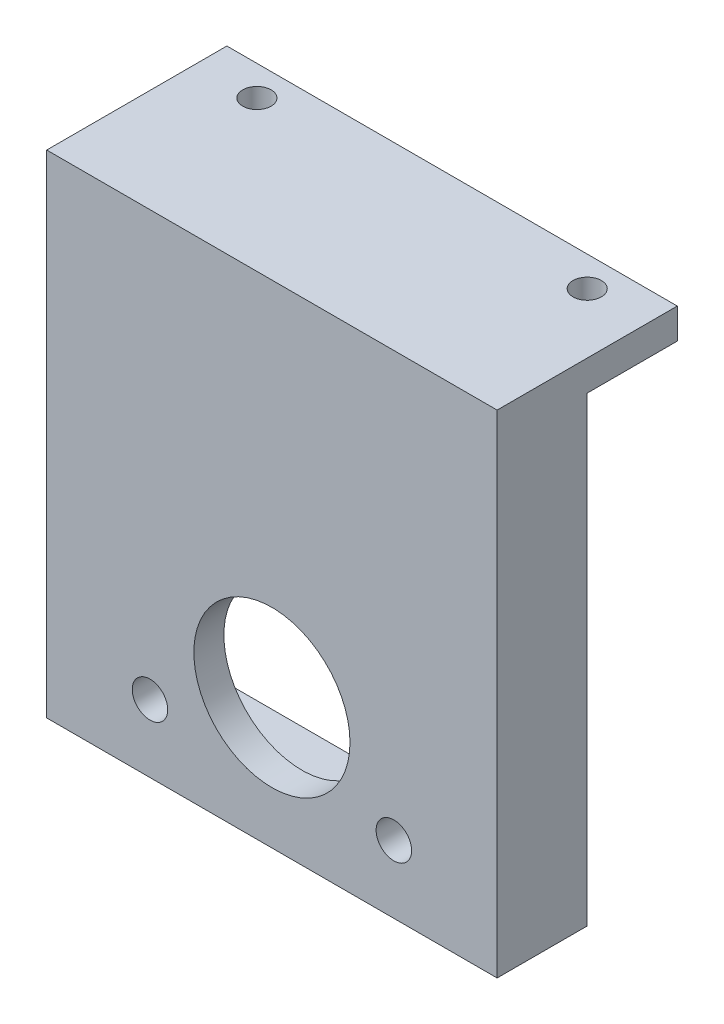
ISO-10303-21;
HEADER;
FILE_DESCRIPTION(('STEP AP214'),'2;1');
FILE_NAME('part.step','',(''),(''),'','','');
FILE_SCHEMA(('AUTOMOTIVE_DESIGN { 1 0 10303 214 1 1 1 1 }'));
ENDSEC;
DATA;
#1=APPLICATION_CONTEXT('core data for automotive mechanical design processes');
#2=APPLICATION_PROTOCOL_DEFINITION('international standard','automotive_design',2000,#1);
#3=PRODUCT_CONTEXT('',#1,'mechanical');
#4=PRODUCT('Part','Part','',(#3));
#5=PRODUCT_RELATED_PRODUCT_CATEGORY('part','',(#4));
#6=PRODUCT_DEFINITION_FORMATION('','',#4);
#7=PRODUCT_DEFINITION_CONTEXT('part definition',#1,'design');
#8=PRODUCT_DEFINITION('design','',#6,#7);
#9=PRODUCT_DEFINITION_SHAPE('','',#8);
#10=(LENGTH_UNIT() NAMED_UNIT(*) SI_UNIT(.MILLI.,.METRE.));
#11=(NAMED_UNIT(*) PLANE_ANGLE_UNIT() SI_UNIT($,.RADIAN.));
#12=(NAMED_UNIT(*) SI_UNIT($,.STERADIAN.) SOLID_ANGLE_UNIT());
#13=UNCERTAINTY_MEASURE_WITH_UNIT(LENGTH_MEASURE(1.E-05),#10,'distance_accuracy_value','');
#14=(GEOMETRIC_REPRESENTATION_CONTEXT(3) GLOBAL_UNCERTAINTY_ASSIGNED_CONTEXT((#13)) GLOBAL_UNIT_ASSIGNED_CONTEXT((#10,
#11,#12)) REPRESENTATION_CONTEXT('',''));
#15=CARTESIAN_POINT('',(0.,0.,0.));
#16=DIRECTION('',(0.,0.,1.));
#17=DIRECTION('',(1.,0.,0.));
#18=AXIS2_PLACEMENT_3D('',#15,#16,#17);
#19=CARTESIAN_POINT('',(0.,0.,0.));
#20=DIRECTION('',(0.,0.,-1.));
#21=DIRECTION('',(-1.,0.,0.));
#22=AXIS2_PLACEMENT_3D('',#19,#20,#21);
#23=PLANE('',#22);
#24=DIRECTION('',(-0.999999710307042,0.000761173982153334,0.));
#25=VECTOR('',#24,1.);
#26=CARTESIAN_POINT('',(19.05,39.0361992628786,0.));
#27=LINE('',#26,#25);
#28=CARTESIAN_POINT('',(19.05,39.0361992628786,0.));
#29=VERTEX_POINT('',#28);
#30=CARTESIAN_POINT('',(-19.05,39.0652,0.));
#31=VERTEX_POINT('',#30);
#32=EDGE_CURVE('E57',#29,#31,#27,.T.);
#33=ORIENTED_EDGE('',*,*,#32,.F.);
#34=DIRECTION('',(0.,1.,0.));
#35=VECTOR('',#34,1.);
#36=CARTESIAN_POINT('',(19.05,41.6052,0.));
#37=LINE('',#36,#35);
#38=CARTESIAN_POINT('',(19.05,0.,0.));
#39=VERTEX_POINT('',#38);
#40=EDGE_CURVE('E239',#39,#29,#37,.T.);
#41=ORIENTED_EDGE('',*,*,#40,.F.);
#42=DIRECTION('',(1.,0.,0.));
#43=VECTOR('',#42,1.);
#44=CARTESIAN_POINT('',(-19.05,0.,0.));
#45=LINE('',#44,#43);
#46=CARTESIAN_POINT('',(-19.05,0.,0.));
#47=VERTEX_POINT('',#46);
#48=EDGE_CURVE('E236',#47,#39,#45,.T.);
#49=ORIENTED_EDGE('',*,*,#48,.F.);
#50=DIRECTION('',(0.,-1.,0.));
#51=VECTOR('',#50,1.);
#52=CARTESIAN_POINT('',(-19.05,41.6052,0.));
#53=LINE('',#52,#51);
#54=EDGE_CURVE('E127',#31,#47,#53,.T.);
#55=ORIENTED_EDGE('',*,*,#54,.F.);
#56=EDGE_LOOP('',(#33,#41,#49,#55));
#57=FACE_BOUND('',#56,.T.);
#58=DIRECTION('',(0.,1.,0.));
#59=VECTOR('',#58,1.);
#60=CARTESIAN_POINT('',(16.51,2.54,0.));
#61=LINE('',#60,#59);
#62=CARTESIAN_POINT('',(16.51,2.54,0.));
#63=VERTEX_POINT('',#62);
#64=CARTESIAN_POINT('',(16.51,36.5252,0.));
#65=VERTEX_POINT('',#64);
#66=EDGE_CURVE('E199',#63,#65,#61,.T.);
#67=ORIENTED_EDGE('',*,*,#66,.T.);
#68=DIRECTION('',(-1.,0.,0.));
#69=VECTOR('',#68,1.);
#70=CARTESIAN_POINT('',(-16.51,36.5252,0.));
#71=LINE('',#70,#69);
#72=CARTESIAN_POINT('',(-16.51,36.5252,0.));
#73=VERTEX_POINT('',#72);
#74=EDGE_CURVE('E65',#65,#73,#71,.T.);
#75=ORIENTED_EDGE('',*,*,#74,.T.);
#76=DIRECTION('',(0.,-1.,0.));
#77=VECTOR('',#76,1.);
#78=CARTESIAN_POINT('',(-16.51,36.5252,0.));
#79=LINE('',#78,#77);
#80=CARTESIAN_POINT('',(-16.51,2.54,0.));
#81=VERTEX_POINT('',#80);
#82=EDGE_CURVE('E214',#73,#81,#79,.T.);
#83=ORIENTED_EDGE('',*,*,#82,.T.);
#84=DIRECTION('',(1.,0.,0.));
#85=VECTOR('',#84,1.);
#86=CARTESIAN_POINT('',(-16.51,2.54,0.));
#87=LINE('',#86,#85);
#88=EDGE_CURVE('E218',#81,#63,#87,.T.);
#89=ORIENTED_EDGE('',*,*,#88,.T.);
#90=EDGE_LOOP('',(#67,#75,#83,#89));
#91=FACE_BOUND('',#90,.T.);
#92=ADVANCED_FACE('F39',(#57,#91),#23,.T.);
#93=CARTESIAN_POINT('',(-19.05,0.,5.08));
#94=DIRECTION('',(0.,1.,0.));
#95=DIRECTION('',(0.,0.,1.));
#96=AXIS2_PLACEMENT_3D('',#93,#94,#95);
#97=PLANE('',#96);
#98=ORIENTED_EDGE('',*,*,#48,.T.);
#99=DIRECTION('',(0.,0.,-1.));
#100=VECTOR('',#99,1.);
#101=CARTESIAN_POINT('',(19.05,0.,5.08));
#102=LINE('',#101,#100);
#103=CARTESIAN_POINT('',(19.05,0.,7.62));
#104=VERTEX_POINT('',#103);
#105=EDGE_CURVE('E11',#104,#39,#102,.T.);
#106=ORIENTED_EDGE('',*,*,#105,.F.);
#107=DIRECTION('',(1.,0.,0.));
#108=VECTOR('',#107,1.);
#109=CARTESIAN_POINT('',(-19.05,0.,7.62));
#110=LINE('',#109,#108);
#111=CARTESIAN_POINT('',(-19.05,0.,7.62));
#112=VERTEX_POINT('',#111);
#113=EDGE_CURVE('E135',#112,#104,#110,.T.);
#114=ORIENTED_EDGE('',*,*,#113,.F.);
#115=DIRECTION('',(0.,0.,-1.));
#116=VECTOR('',#115,1.);
#117=CARTESIAN_POINT('',(-19.05,0.,5.08));
#118=LINE('',#117,#116);
#119=EDGE_CURVE('E121',#112,#47,#118,.T.);
#120=ORIENTED_EDGE('',*,*,#119,.T.);
#121=EDGE_LOOP('',(#98,#106,#114,#120));
#122=FACE_BOUND('',#121,.T.);
#123=ADVANCED_FACE('F41',(#122),#97,.F.);
#124=CARTESIAN_POINT('',(19.05,41.6052,5.08));
#125=DIRECTION('',(-1.,0.,0.));
#126=DIRECTION('',(0.,0.,1.));
#127=AXIS2_PLACEMENT_3D('',#124,#125,#126);
#128=PLANE('',#127);
#129=ORIENTED_EDGE('',*,*,#40,.T.);
#130=DIRECTION('',(0.,0.,1.));
#131=VECTOR('',#130,1.);
#132=CARTESIAN_POINT('',(19.05,39.0361992628786,-7.62));
#133=LINE('',#132,#131);
#134=CARTESIAN_POINT('',(19.05,39.0361992628786,-7.62));
#135=VERTEX_POINT('',#134);
#136=EDGE_CURVE('E190',#135,#29,#133,.T.);
#137=ORIENTED_EDGE('',*,*,#136,.F.);
#138=DIRECTION('',(0.,-1.,0.));
#139=VECTOR('',#138,1.);
#140=CARTESIAN_POINT('',(19.05,41.6052,-7.62));
#141=LINE('',#140,#139);
#142=CARTESIAN_POINT('',(19.05,41.6052,-7.62));
#143=VERTEX_POINT('',#142);
#144=EDGE_CURVE('E170',#143,#135,#141,.T.);
#145=ORIENTED_EDGE('',*,*,#144,.F.);
#146=DIRECTION('',(0.,0.,-1.));
#147=VECTOR('',#146,1.);
#148=CARTESIAN_POINT('',(19.05,41.6052,5.08));
#149=LINE('',#148,#147);
#150=CARTESIAN_POINT('',(19.05,41.6052,7.62));
#151=VERTEX_POINT('',#150);
#152=EDGE_CURVE('E49',#151,#143,#149,.T.);
#153=ORIENTED_EDGE('',*,*,#152,.F.);
#154=DIRECTION('',(0.,1.,0.));
#155=VECTOR('',#154,1.);
#156=CARTESIAN_POINT('',(19.05,0.,7.62));
#157=LINE('',#156,#155);
#158=EDGE_CURVE('E140',#104,#151,#157,.T.);
#159=ORIENTED_EDGE('',*,*,#158,.F.);
#160=ORIENTED_EDGE('',*,*,#105,.T.);
#161=EDGE_LOOP('',(#129,#137,#145,#153,#159,#160));
#162=FACE_BOUND('',#161,.T.);
#163=ADVANCED_FACE('F296',(#162),#128,.F.);
#164=CARTESIAN_POINT('',(-19.05,41.6052,5.08));
#165=DIRECTION('',(0.,-1.,0.));
#166=DIRECTION('',(0.,0.,-1.));
#167=AXIS2_PLACEMENT_3D('',#164,#165,#166);
#168=PLANE('',#167);
#169=CARTESIAN_POINT('',(-13.97,41.6052,-5.08));
#170=DIRECTION('',(0.,1.,0.));
#171=DIRECTION('',(0.,0.,1.));
#172=AXIS2_PLACEMENT_3D('',#169,#170,#171);
#173=CIRCLE('',#172,1.19999999999999);
#174=CARTESIAN_POINT('',(-13.97,41.6052,-3.88000000000001));
#175=VERTEX_POINT('',#174);
#176=EDGE_CURVE('E160',#175,#175,#173,.T.);
#177=ORIENTED_EDGE('',*,*,#176,.F.);
#178=EDGE_LOOP('',(#177));
#179=FACE_BOUND('',#178,.T.);
#180=CARTESIAN_POINT('',(13.97,41.6052,-5.08));
#181=DIRECTION('',(0.,1.,0.));
#182=DIRECTION('',(0.,0.,1.));
#183=AXIS2_PLACEMENT_3D('',#180,#181,#182);
#184=CIRCLE('',#183,1.19999999999999);
#185=CARTESIAN_POINT('',(13.97,41.6052,-3.88000000000001));
#186=VERTEX_POINT('',#185);
#187=EDGE_CURVE('E165',#186,#186,#184,.T.);
#188=ORIENTED_EDGE('',*,*,#187,.F.);
#189=EDGE_LOOP('',(#188));
#190=FACE_BOUND('',#189,.T.);
#191=ORIENTED_EDGE('',*,*,#152,.T.);
#192=DIRECTION('',(1.,0.,0.));
#193=VECTOR('',#192,1.);
#194=CARTESIAN_POINT('',(19.05,41.6052,-7.62));
#195=LINE('',#194,#193);
#196=CARTESIAN_POINT('',(-19.05,41.6052,-7.62));
#197=VERTEX_POINT('',#196);
#198=EDGE_CURVE('E181',#197,#143,#195,.T.);
#199=ORIENTED_EDGE('',*,*,#198,.F.);
#200=DIRECTION('',(0.,0.,-1.));
#201=VECTOR('',#200,1.);
#202=CARTESIAN_POINT('',(-19.05,41.6052,5.08));
#203=LINE('',#202,#201);
#204=CARTESIAN_POINT('',(-19.05,41.6052,7.62));
#205=VERTEX_POINT('',#204);
#206=EDGE_CURVE('E132',#205,#197,#203,.T.);
#207=ORIENTED_EDGE('',*,*,#206,.F.);
#208=DIRECTION('',(-1.,0.,0.));
#209=VECTOR('',#208,1.);
#210=CARTESIAN_POINT('',(19.05,41.6052,7.62));
#211=LINE('',#210,#209);
#212=EDGE_CURVE('E146',#151,#205,#211,.T.);
#213=ORIENTED_EDGE('',*,*,#212,.F.);
#214=EDGE_LOOP('',(#191,#199,#207,#213));
#215=FACE_BOUND('',#214,.T.);
#216=ADVANCED_FACE('F304',(#179,#190,#215),#168,.F.);
#217=CARTESIAN_POINT('',(-19.05,41.6052,5.08));
#218=DIRECTION('',(1.,0.,0.));
#219=DIRECTION('',(0.,0.,-1.));
#220=AXIS2_PLACEMENT_3D('',#217,#218,#219);
#221=PLANE('',#220);
#222=ORIENTED_EDGE('',*,*,#206,.T.);
#223=DIRECTION('',(0.,1.,0.));
#224=VECTOR('',#223,1.);
#225=CARTESIAN_POINT('',(-19.05,39.0652,-7.62));
#226=LINE('',#225,#224);
#227=CARTESIAN_POINT('',(-19.05,39.0652,-7.62));
#228=VERTEX_POINT('',#227);
#229=EDGE_CURVE('E177',#228,#197,#226,.T.);
#230=ORIENTED_EDGE('',*,*,#229,.F.);
#231=DIRECTION('',(0.,0.,1.));
#232=VECTOR('',#231,1.);
#233=CARTESIAN_POINT('',(-19.05,39.0652,-7.62));
#234=LINE('',#233,#232);
#235=EDGE_CURVE('E185',#228,#31,#234,.T.);
#236=ORIENTED_EDGE('',*,*,#235,.T.);
#237=ORIENTED_EDGE('',*,*,#54,.T.);
#238=ORIENTED_EDGE('',*,*,#119,.F.);
#239=DIRECTION('',(0.,-1.,0.));
#240=VECTOR('',#239,1.);
#241=CARTESIAN_POINT('',(-19.05,41.6052,7.62));
#242=LINE('',#241,#240);
#243=EDGE_CURVE('E125',#205,#112,#242,.T.);
#244=ORIENTED_EDGE('',*,*,#243,.F.);
#245=EDGE_LOOP('',(#222,#230,#236,#237,#238,#244));
#246=FACE_BOUND('',#245,.T.);
#247=ADVANCED_FACE('F123',(#246),#221,.F.);
#248=CARTESIAN_POINT('',(-16.51,36.5252,5.08));
#249=DIRECTION('',(0.,-1.,0.));
#250=DIRECTION('',(0.,0.,-1.));
#251=AXIS2_PLACEMENT_3D('',#248,#249,#250);
#252=PLANE('',#251);
#253=ORIENTED_EDGE('',*,*,#74,.F.);
#254=DIRECTION('',(0.,0.,-1.));
#255=VECTOR('',#254,1.);
#256=CARTESIAN_POINT('',(16.51,36.5252,5.08));
#257=LINE('',#256,#255);
#258=CARTESIAN_POINT('',(16.51,36.5252,5.08));
#259=VERTEX_POINT('',#258);
#260=EDGE_CURVE('E211',#259,#65,#257,.T.);
#261=ORIENTED_EDGE('',*,*,#260,.F.);
#262=DIRECTION('',(-1.,0.,0.));
#263=VECTOR('',#262,1.);
#264=CARTESIAN_POINT('',(-16.51,36.5252,5.08));
#265=LINE('',#264,#263);
#266=CARTESIAN_POINT('',(-16.51,36.5252,5.08));
#267=VERTEX_POINT('',#266);
#268=EDGE_CURVE('E194',#259,#267,#265,.T.);
#269=ORIENTED_EDGE('',*,*,#268,.T.);
#270=DIRECTION('',(0.,0.,-1.));
#271=VECTOR('',#270,1.);
#272=CARTESIAN_POINT('',(-16.51,36.5252,5.08));
#273=LINE('',#272,#271);
#274=EDGE_CURVE('E233',#267,#73,#273,.T.);
#275=ORIENTED_EDGE('',*,*,#274,.T.);
#276=EDGE_LOOP('',(#253,#261,#269,#275));
#277=FACE_BOUND('',#276,.T.);
#278=ADVANCED_FACE('F300',(#277),#252,.T.);
#279=CARTESIAN_POINT('',(-16.51,36.5252,5.08));
#280=DIRECTION('',(1.,0.,0.));
#281=DIRECTION('',(0.,1.,0.));
#282=AXIS2_PLACEMENT_3D('',#279,#280,#281);
#283=PLANE('',#282);
#284=ORIENTED_EDGE('',*,*,#82,.F.);
#285=ORIENTED_EDGE('',*,*,#274,.F.);
#286=DIRECTION('',(0.,-1.,0.));
#287=VECTOR('',#286,1.);
#288=CARTESIAN_POINT('',(-16.51,36.5252,5.08));
#289=LINE('',#288,#287);
#290=CARTESIAN_POINT('',(-16.51,2.54,5.08));
#291=VERTEX_POINT('',#290);
#292=EDGE_CURVE('E198',#267,#291,#289,.T.);
#293=ORIENTED_EDGE('',*,*,#292,.T.);
#294=DIRECTION('',(0.,0.,-1.));
#295=VECTOR('',#294,1.);
#296=CARTESIAN_POINT('',(-16.51,2.54,5.08));
#297=LINE('',#296,#295);
#298=EDGE_CURVE('E230',#291,#81,#297,.T.);
#299=ORIENTED_EDGE('',*,*,#298,.T.);
#300=EDGE_LOOP('',(#284,#285,#293,#299));
#301=FACE_BOUND('',#300,.T.);
#302=ADVANCED_FACE('F338',(#301),#283,.T.);
#303=CARTESIAN_POINT('',(-16.51,2.54,5.08));
#304=DIRECTION('',(0.,1.,0.));
#305=DIRECTION('',(0.,0.,1.));
#306=AXIS2_PLACEMENT_3D('',#303,#304,#305);
#307=PLANE('',#306);
#308=ORIENTED_EDGE('',*,*,#88,.F.);
#309=ORIENTED_EDGE('',*,*,#298,.F.);
#310=DIRECTION('',(1.,0.,0.));
#311=VECTOR('',#310,1.);
#312=CARTESIAN_POINT('',(-16.51,2.54,5.08));
#313=LINE('',#312,#311);
#314=CARTESIAN_POINT('',(16.51,2.54,5.08));
#315=VERTEX_POINT('',#314);
#316=EDGE_CURVE('E203',#291,#315,#313,.T.);
#317=ORIENTED_EDGE('',*,*,#316,.T.);
#318=DIRECTION('',(0.,0.,-1.));
#319=VECTOR('',#318,1.);
#320=CARTESIAN_POINT('',(16.51,2.54,5.08));
#321=LINE('',#320,#319);
#322=EDGE_CURVE('E227',#315,#63,#321,.T.);
#323=ORIENTED_EDGE('',*,*,#322,.T.);
#324=EDGE_LOOP('',(#308,#309,#317,#323));
#325=FACE_BOUND('',#324,.T.);
#326=ADVANCED_FACE('F335',(#325),#307,.T.);
#327=CARTESIAN_POINT('',(16.51,2.54,5.08));
#328=DIRECTION('',(-1.,0.,0.));
#329=DIRECTION('',(0.,0.,1.));
#330=AXIS2_PLACEMENT_3D('',#327,#328,#329);
#331=PLANE('',#330);
#332=ORIENTED_EDGE('',*,*,#66,.F.);
#333=ORIENTED_EDGE('',*,*,#322,.F.);
#334=DIRECTION('',(0.,1.,0.));
#335=VECTOR('',#334,1.);
#336=CARTESIAN_POINT('',(16.51,2.54,5.08));
#337=LINE('',#336,#335);
#338=EDGE_CURVE('E207',#315,#259,#337,.T.);
#339=ORIENTED_EDGE('',*,*,#338,.T.);
#340=ORIENTED_EDGE('',*,*,#260,.T.);
#341=EDGE_LOOP('',(#332,#333,#339,#340));
#342=FACE_BOUND('',#341,.T.);
#343=ADVANCED_FACE('F329',(#342),#331,.T.);
#344=CARTESIAN_POINT('',(19.05,39.0361992628786,-7.62));
#345=DIRECTION('',(0.000761173982153334,0.999999710307042,0.));
#346=DIRECTION('',(-0.999999710307042,0.000761173982153334,0.));
#347=AXIS2_PLACEMENT_3D('',#344,#345,#346);
#348=PLANE('',#347);
#349=CARTESIAN_POINT('',(-13.97,39.0613332350505,-5.08));
#350=DIRECTION('',(0.000761173982153334,0.999999710307042,0.));
#351=DIRECTION('',(-0.999999710307042,0.000761173982153334,0.));
#352=AXIS2_PLACEMENT_3D('',#349,#350,#351);
#353=ELLIPSE('',#352,1.20000034763164,1.19999999999999);
#354=CARTESIAN_POINT('',(-15.17,39.0622466440937,-5.08));
#355=VERTEX_POINT('',#354);
#356=EDGE_CURVE('E164',#355,#355,#353,.T.);
#357=ORIENTED_EDGE('',*,*,#356,.T.);
#358=EDGE_LOOP('',(#357));
#359=FACE_BOUND('',#358,.T.);
#360=CARTESIAN_POINT('',(13.97,39.0400660278282,-5.08));
#361=DIRECTION('',(0.000761173982153334,0.999999710307042,0.));
#362=DIRECTION('',(-0.999999710307042,0.000761173982153334,0.));
#363=AXIS2_PLACEMENT_3D('',#360,#361,#362);
#364=ELLIPSE('',#363,1.20000034763164,1.19999999999999);
#365=CARTESIAN_POINT('',(12.77,39.0409794368714,-5.08));
#366=VERTEX_POINT('',#365);
#367=EDGE_CURVE('E169',#366,#366,#364,.T.);
#368=ORIENTED_EDGE('',*,*,#367,.T.);
#369=EDGE_LOOP('',(#368));
#370=FACE_BOUND('',#369,.T.);
#371=ORIENTED_EDGE('',*,*,#32,.T.);
#372=ORIENTED_EDGE('',*,*,#235,.F.);
#373=DIRECTION('',(-0.999999710307042,0.000761173982153334,0.));
#374=VECTOR('',#373,1.);
#375=CARTESIAN_POINT('',(19.05,39.0361992628786,-7.62));
#376=LINE('',#375,#374);
#377=EDGE_CURVE('E174',#135,#228,#376,.T.);
#378=ORIENTED_EDGE('',*,*,#377,.F.);
#379=ORIENTED_EDGE('',*,*,#136,.T.);
#380=EDGE_LOOP('',(#371,#372,#378,#379));
#381=FACE_BOUND('',#380,.T.);
#382=ADVANCED_FACE('F314',(#359,#370,#381),#348,.F.);
#383=CARTESIAN_POINT('',(0.,0.,-7.62));
#384=DIRECTION('',(0.,0.,-1.));
#385=DIRECTION('',(-1.,0.,0.));
#386=AXIS2_PLACEMENT_3D('',#383,#384,#385);
#387=PLANE('',#386);
#388=ORIENTED_EDGE('',*,*,#144,.T.);
#389=ORIENTED_EDGE('',*,*,#377,.T.);
#390=ORIENTED_EDGE('',*,*,#229,.T.);
#391=ORIENTED_EDGE('',*,*,#198,.T.);
#392=EDGE_LOOP('',(#388,#389,#390,#391));
#393=FACE_BOUND('',#392,.T.);
#394=ADVANCED_FACE('F318',(#393),#387,.T.);
#395=CARTESIAN_POINT('',(13.97,41.6052,-5.08));
#396=DIRECTION('',(0.,1.,0.));
#397=DIRECTION('',(0.,0.,1.));
#398=AXIS2_PLACEMENT_3D('',#395,#396,#397);
#399=CYLINDRICAL_SURFACE('',#398,1.19999999999999);
#400=ORIENTED_EDGE('',*,*,#187,.T.);
#401=EDGE_LOOP('',(#400));
#402=FACE_BOUND('',#401,.T.);
#403=ORIENTED_EDGE('',*,*,#367,.F.);
#404=EDGE_LOOP('',(#403));
#405=FACE_BOUND('',#404,.T.);
#406=ADVANCED_FACE('F287',(#402,#405),#399,.F.);
#407=CARTESIAN_POINT('',(-13.97,41.6052,-5.08));
#408=DIRECTION('',(0.,1.,0.));
#409=DIRECTION('',(0.,0.,1.));
#410=AXIS2_PLACEMENT_3D('',#407,#408,#409);
#411=CYLINDRICAL_SURFACE('',#410,1.19999999999999);
#412=ORIENTED_EDGE('',*,*,#176,.T.);
#413=EDGE_LOOP('',(#412));
#414=FACE_BOUND('',#413,.T.);
#415=ORIENTED_EDGE('',*,*,#356,.F.);
#416=EDGE_LOOP('',(#415));
#417=FACE_BOUND('',#416,.T.);
#418=ADVANCED_FACE('F277',(#414,#417),#411,.F.);
#419=CARTESIAN_POINT('',(0.,0.,7.62));
#420=DIRECTION('',(0.,0.,1.));
#421=DIRECTION('',(1.,0.,0.));
#422=AXIS2_PLACEMENT_3D('',#419,#420,#421);
#423=PLANE('',#422);
#424=CARTESIAN_POINT('',(-10.31494,5.715,7.62));
#425=DIRECTION('',(0.,0.,1.));
#426=DIRECTION('',(1.,0.,0.));
#427=AXIS2_PLACEMENT_3D('',#424,#425,#426);
#428=CIRCLE('',#427,1.50114);
#429=CARTESIAN_POINT('',(-8.8138,5.715,7.62));
#430=VERTEX_POINT('',#429);
#431=EDGE_CURVE('E256',#430,#430,#428,.T.);
#432=ORIENTED_EDGE('',*,*,#431,.F.);
#433=EDGE_LOOP('',(#432));
#434=FACE_BOUND('',#433,.T.);
#435=CARTESIAN_POINT('',(10.31494,5.715,7.62));
#436=DIRECTION('',(0.,0.,1.));
#437=DIRECTION('',(1.,0.,0.));
#438=AXIS2_PLACEMENT_3D('',#435,#436,#437);
#439=CIRCLE('',#438,1.50114);
#440=CARTESIAN_POINT('',(11.81608,5.715,7.62));
#441=VERTEX_POINT('',#440);
#442=EDGE_CURVE('E263',#441,#441,#439,.T.);
#443=ORIENTED_EDGE('',*,*,#442,.F.);
#444=EDGE_LOOP('',(#443));
#445=FACE_BOUND('',#444,.T.);
#446=ORIENTED_EDGE('',*,*,#243,.T.);
#447=ORIENTED_EDGE('',*,*,#113,.T.);
#448=ORIENTED_EDGE('',*,*,#158,.T.);
#449=ORIENTED_EDGE('',*,*,#212,.T.);
#450=EDGE_LOOP('',(#446,#447,#448,#449));
#451=FACE_BOUND('',#450,.T.);
#452=CARTESIAN_POINT('',(0.,11.02614,7.62));
#453=DIRECTION('',(0.,0.,1.));
#454=DIRECTION('',(1.,0.,0.));
#455=AXIS2_PLACEMENT_3D('',#452,#453,#454);
#456=CIRCLE('',#455,6.604);
#457=CARTESIAN_POINT('',(6.604,11.02614,7.62));
#458=VERTEX_POINT('',#457);
#459=EDGE_CURVE('E148',#458,#458,#456,.T.);
#460=ORIENTED_EDGE('',*,*,#459,.F.);
#461=EDGE_LOOP('',(#460));
#462=FACE_BOUND('',#461,.T.);
#463=ADVANCED_FACE('F143',(#434,#445,#451,#462),#423,.T.);
#464=CARTESIAN_POINT('',(0.,0.,5.08));
#465=DIRECTION('',(0.,0.,1.));
#466=DIRECTION('',(1.,0.,0.));
#467=AXIS2_PLACEMENT_3D('',#464,#465,#466);
#468=PLANE('',#467);
#469=CARTESIAN_POINT('',(-10.31494,5.715,5.08));
#470=DIRECTION('',(0.,0.,1.));
#471=DIRECTION('',(1.,0.,0.));
#472=AXIS2_PLACEMENT_3D('',#469,#470,#471);
#473=CIRCLE('',#472,1.50114);
#474=CARTESIAN_POINT('',(-8.8138,5.715,5.08));
#475=VERTEX_POINT('',#474);
#476=EDGE_CURVE('E43',#475,#475,#473,.T.);
#477=ORIENTED_EDGE('',*,*,#476,.T.);
#478=EDGE_LOOP('',(#477));
#479=FACE_BOUND('',#478,.T.);
#480=CARTESIAN_POINT('',(10.31494,5.715,5.08));
#481=DIRECTION('',(0.,0.,1.));
#482=DIRECTION('',(1.,0.,0.));
#483=AXIS2_PLACEMENT_3D('',#480,#481,#482);
#484=CIRCLE('',#483,1.50114);
#485=CARTESIAN_POINT('',(11.81608,5.715,5.08));
#486=VERTEX_POINT('',#485);
#487=EDGE_CURVE('E253',#486,#486,#484,.T.);
#488=ORIENTED_EDGE('',*,*,#487,.T.);
#489=EDGE_LOOP('',(#488));
#490=FACE_BOUND('',#489,.T.);
#491=ORIENTED_EDGE('',*,*,#268,.F.);
#492=ORIENTED_EDGE('',*,*,#338,.F.);
#493=ORIENTED_EDGE('',*,*,#316,.F.);
#494=ORIENTED_EDGE('',*,*,#292,.F.);
#495=EDGE_LOOP('',(#491,#492,#493,#494));
#496=FACE_BOUND('',#495,.T.);
#497=CARTESIAN_POINT('',(0.,11.02614,5.08));
#498=DIRECTION('',(0.,0.,1.));
#499=DIRECTION('',(1.,0.,0.));
#500=AXIS2_PLACEMENT_3D('',#497,#498,#499);
#501=CIRCLE('',#500,6.604);
#502=CARTESIAN_POINT('',(6.604,11.02614,5.08));
#503=VERTEX_POINT('',#502);
#504=EDGE_CURVE('E152',#503,#503,#501,.T.);
#505=ORIENTED_EDGE('',*,*,#504,.T.);
#506=EDGE_LOOP('',(#505));
#507=FACE_BOUND('',#506,.T.);
#508=ADVANCED_FACE('F276',(#479,#490,#496,#507),#468,.F.);
#509=CARTESIAN_POINT('',(0.,11.02614,7.62));
#510=DIRECTION('',(0.,0.,-1.));
#511=DIRECTION('',(-1.,0.,0.));
#512=AXIS2_PLACEMENT_3D('',#509,#510,#511);
#513=CYLINDRICAL_SURFACE('',#512,6.604);
#514=ORIENTED_EDGE('',*,*,#459,.T.);
#515=EDGE_LOOP('',(#514));
#516=FACE_BOUND('',#515,.T.);
#517=ORIENTED_EDGE('',*,*,#504,.F.);
#518=EDGE_LOOP('',(#517));
#519=FACE_BOUND('',#518,.T.);
#520=ADVANCED_FACE('F284',(#516,#519),#513,.F.);
#521=CARTESIAN_POINT('',(10.31494,5.715,-7.62));
#522=DIRECTION('',(0.,0.,1.));
#523=DIRECTION('',(1.,0.,0.));
#524=AXIS2_PLACEMENT_3D('',#521,#522,#523);
#525=CYLINDRICAL_SURFACE('',#524,1.50114);
#526=ORIENTED_EDGE('',*,*,#442,.T.);
#527=EDGE_LOOP('',(#526));
#528=FACE_BOUND('',#527,.T.);
#529=ORIENTED_EDGE('',*,*,#487,.F.);
#530=EDGE_LOOP('',(#529));
#531=FACE_BOUND('',#530,.T.);
#532=ADVANCED_FACE('F272',(#528,#531),#525,.F.);
#533=CARTESIAN_POINT('',(-10.31494,5.715,-7.62));
#534=DIRECTION('',(0.,0.,1.));
#535=DIRECTION('',(1.,0.,0.));
#536=AXIS2_PLACEMENT_3D('',#533,#534,#535);
#537=CYLINDRICAL_SURFACE('',#536,1.50114);
#538=ORIENTED_EDGE('',*,*,#431,.T.);
#539=EDGE_LOOP('',(#538));
#540=FACE_BOUND('',#539,.T.);
#541=ORIENTED_EDGE('',*,*,#476,.F.);
#542=EDGE_LOOP('',(#541));
#543=FACE_BOUND('',#542,.T.);
#544=ADVANCED_FACE('F361',(#540,#543),#537,.F.);
#545=CLOSED_SHELL('',(#92,#123,#163,#216,#247,#278,#302,#326,#343,#382,#394,#406,#418,#463,#508,
#520,#532,#544));
#546=MANIFOLD_SOLID_BREP('B2',#545);
#547=ADVANCED_BREP_SHAPE_REPRESENTATION('',(#18,#546),#14);
#548=SHAPE_DEFINITION_REPRESENTATION(#9,#547);
ENDSEC;
END-ISO-10303-21;
